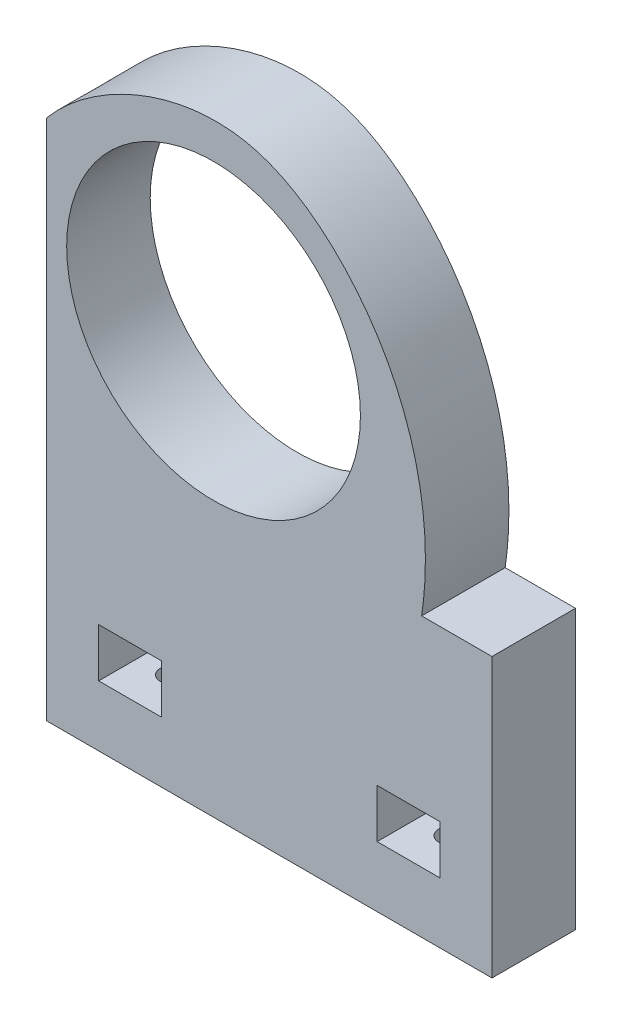
ISO-10303-21;
HEADER;
FILE_DESCRIPTION(('STEP AP214'),'2;1');
FILE_NAME('part.step','',(''),(''),'','','');
FILE_SCHEMA(('AUTOMOTIVE_DESIGN { 1 0 10303 214 1 1 1 1 }'));
ENDSEC;
DATA;
#1=APPLICATION_CONTEXT('core data for automotive mechanical design processes');
#2=APPLICATION_PROTOCOL_DEFINITION('international standard','automotive_design',2000,#1);
#3=PRODUCT_CONTEXT('',#1,'mechanical');
#4=PRODUCT('Part','Part','',(#3));
#5=PRODUCT_RELATED_PRODUCT_CATEGORY('part','',(#4));
#6=PRODUCT_DEFINITION_FORMATION('','',#4);
#7=PRODUCT_DEFINITION_CONTEXT('part definition',#1,'design');
#8=PRODUCT_DEFINITION('design','',#6,#7);
#9=PRODUCT_DEFINITION_SHAPE('','',#8);
#10=(LENGTH_UNIT() NAMED_UNIT(*) SI_UNIT(.MILLI.,.METRE.));
#11=(NAMED_UNIT(*) PLANE_ANGLE_UNIT() SI_UNIT($,.RADIAN.));
#12=(NAMED_UNIT(*) SI_UNIT($,.STERADIAN.) SOLID_ANGLE_UNIT());
#13=UNCERTAINTY_MEASURE_WITH_UNIT(LENGTH_MEASURE(1.E-05),#10,'distance_accuracy_value','');
#14=(GEOMETRIC_REPRESENTATION_CONTEXT(3) GLOBAL_UNCERTAINTY_ASSIGNED_CONTEXT((#13)) GLOBAL_UNIT_ASSIGNED_CONTEXT((#10,
#11,#12)) REPRESENTATION_CONTEXT('',''));
#15=CARTESIAN_POINT('',(0.,0.,0.));
#16=DIRECTION('',(0.,0.,1.));
#17=DIRECTION('',(1.,0.,0.));
#18=AXIS2_PLACEMENT_3D('',#15,#16,#17);
#19=CARTESIAN_POINT('',(-32.,55.,12.));
#20=CARTESIAN_POINT('',(-25.4672585375101,62.875582675928,12.));
#21=CARTESIAN_POINT('',(-5.81735149897092,72.0292699085318,12.));
#22=CARTESIAN_POINT('',(19.3343852914669,52.0751938029211,12.));
#23=CARTESIAN_POINT('',(23.7759075944806,32.7099363786866,12.));
#24=CARTESIAN_POINT('',(21.8947368421052,20.,12.));
#25=B_SPLINE_CURVE_WITH_KNOTS('',3,(#19,#20,#21,#22,#23,#24),.UNSPECIFIED.,.F.,.F.,(4,1,1,4),
(0.,0.370538339523064,0.573066510900843,1.),.UNSPECIFIED.);
#26=DIRECTION('',(0.,0.,-1.));
#27=VECTOR('',#26,1.);
#28=SURFACE_OF_LINEAR_EXTRUSION('',#25,#27);
#29=CARTESIAN_POINT('',(-32.,55.,0.));
#30=CARTESIAN_POINT('',(-25.4672585375101,62.875582675928,0.));
#31=CARTESIAN_POINT('',(-5.81735149897092,72.0292699085318,0.));
#32=CARTESIAN_POINT('',(19.3343852914669,52.0751938029211,0.));
#33=CARTESIAN_POINT('',(23.7759075944806,32.7099363786866,0.));
#34=CARTESIAN_POINT('',(21.8947368421052,20.,0.));
#35=B_SPLINE_CURVE_WITH_KNOTS('',3,(#29,#30,#31,#32,#33,#34),.UNSPECIFIED.,.F.,.F.,(4,1,1,4),
(0.,0.370538339523064,0.573066510900843,1.),.UNSPECIFIED.);
#36=CARTESIAN_POINT('',(-32.,55.,0.));
#37=VERTEX_POINT('',#36);
#38=CARTESIAN_POINT('',(21.8947368421052,20.,0.));
#39=VERTEX_POINT('',#38);
#40=EDGE_CURVE('E220',#37,#39,#35,.T.);
#41=ORIENTED_EDGE('',*,*,#40,.F.);
#42=DIRECTION('',(0.,0.,-1.));
#43=VECTOR('',#42,1.);
#44=CARTESIAN_POINT('',(-32.,55.,12.));
#45=LINE('',#44,#43);
#46=CARTESIAN_POINT('',(-32.,55.,12.));
#47=VERTEX_POINT('',#46);
#48=EDGE_CURVE('E11',#47,#37,#45,.T.);
#49=ORIENTED_EDGE('',*,*,#48,.F.);
#50=CARTESIAN_POINT('',(21.8947368421052,20.,12.));
#51=VERTEX_POINT('',#50);
#52=EDGE_CURVE('E222',#47,#51,#25,.T.);
#53=ORIENTED_EDGE('',*,*,#52,.T.);
#54=DIRECTION('',(0.,0.,-1.));
#55=VECTOR('',#54,1.);
#56=CARTESIAN_POINT('',(21.8947368421052,20.,12.));
#57=LINE('',#56,#55);
#58=EDGE_CURVE('E242',#51,#39,#57,.T.);
#59=ORIENTED_EDGE('',*,*,#58,.T.);
#60=EDGE_LOOP('',(#41,#49,#53,#59));
#61=FACE_BOUND('',#60,.T.);
#62=ADVANCED_FACE('F44',(#61),#28,.T.);
#63=CARTESIAN_POINT('',(-32.,0.,12.));
#64=DIRECTION('',(-1.,0.,0.));
#65=DIRECTION('',(0.,0.,1.));
#66=AXIS2_PLACEMENT_3D('',#63,#64,#65);
#67=PLANE('',#66);
#68=DIRECTION('',(0.,1.,0.));
#69=VECTOR('',#68,1.);
#70=CARTESIAN_POINT('',(-32.,0.,0.));
#71=LINE('',#70,#69);
#72=CARTESIAN_POINT('',(-32.,-20.,0.));
#73=VERTEX_POINT('',#72);
#74=EDGE_CURVE('E247',#73,#37,#71,.T.);
#75=ORIENTED_EDGE('',*,*,#74,.F.);
#76=DIRECTION('',(0.,0.,-1.));
#77=VECTOR('',#76,1.);
#78=CARTESIAN_POINT('',(-32.,-20.,12.));
#79=LINE('',#78,#77);
#80=CARTESIAN_POINT('',(-32.,-20.,12.));
#81=VERTEX_POINT('',#80);
#82=EDGE_CURVE('E53',#81,#73,#79,.T.);
#83=ORIENTED_EDGE('',*,*,#82,.F.);
#84=DIRECTION('',(0.,1.,0.));
#85=VECTOR('',#84,1.);
#86=CARTESIAN_POINT('',(-32.,0.,12.));
#87=LINE('',#86,#85);
#88=EDGE_CURVE('E228',#81,#47,#87,.T.);
#89=ORIENTED_EDGE('',*,*,#88,.T.);
#90=ORIENTED_EDGE('',*,*,#48,.T.);
#91=EDGE_LOOP('',(#75,#83,#89,#90));
#92=FACE_BOUND('',#91,.T.);
#93=ADVANCED_FACE('F291',(#92),#67,.T.);
#94=CARTESIAN_POINT('',(0.,-20.,12.));
#95=DIRECTION('',(0.,1.,0.));
#96=DIRECTION('',(-1.,0.,0.));
#97=AXIS2_PLACEMENT_3D('',#94,#95,#96);
#98=PLANE('',#97);
#99=CARTESIAN_POINT('',(-20.,-20.,6.));
#100=DIRECTION('',(0.,-1.,0.));
#101=DIRECTION('',(1.,0.,0.));
#102=AXIS2_PLACEMENT_3D('',#99,#100,#101);
#103=CIRCLE('',#102,1.65);
#104=CARTESIAN_POINT('',(-18.35,-20.,6.));
#105=VERTEX_POINT('',#104);
#106=EDGE_CURVE('E210',#105,#105,#103,.T.);
#107=ORIENTED_EDGE('',*,*,#106,.F.);
#108=EDGE_LOOP('',(#107));
#109=FACE_BOUND('',#108,.T.);
#110=CARTESIAN_POINT('',(20.,-20.,6.));
#111=DIRECTION('',(0.,-1.,0.));
#112=DIRECTION('',(1.,0.,0.));
#113=AXIS2_PLACEMENT_3D('',#110,#111,#112);
#114=CIRCLE('',#113,1.65);
#115=CARTESIAN_POINT('',(21.65,-20.,6.));
#116=VERTEX_POINT('',#115);
#117=EDGE_CURVE('E214',#116,#116,#114,.T.);
#118=ORIENTED_EDGE('',*,*,#117,.F.);
#119=EDGE_LOOP('',(#118));
#120=FACE_BOUND('',#119,.T.);
#121=DIRECTION('',(1.,0.,0.));
#122=VECTOR('',#121,1.);
#123=CARTESIAN_POINT('',(0.,-20.,0.));
#124=LINE('',#123,#122);
#125=CARTESIAN_POINT('',(32.,-20.,0.));
#126=VERTEX_POINT('',#125);
#127=EDGE_CURVE('E253',#73,#126,#124,.T.);
#128=ORIENTED_EDGE('',*,*,#127,.T.);
#129=DIRECTION('',(0.,0.,-1.));
#130=VECTOR('',#129,1.);
#131=CARTESIAN_POINT('',(32.,-20.,12.));
#132=LINE('',#131,#130);
#133=CARTESIAN_POINT('',(32.,-20.,12.));
#134=VERTEX_POINT('',#133);
#135=EDGE_CURVE('E263',#134,#126,#132,.T.);
#136=ORIENTED_EDGE('',*,*,#135,.F.);
#137=DIRECTION('',(1.,0.,0.));
#138=VECTOR('',#137,1.);
#139=CARTESIAN_POINT('',(0.,-20.,12.));
#140=LINE('',#139,#138);
#141=EDGE_CURVE('E235',#81,#134,#140,.T.);
#142=ORIENTED_EDGE('',*,*,#141,.F.);
#143=ORIENTED_EDGE('',*,*,#82,.T.);
#144=EDGE_LOOP('',(#128,#136,#142,#143));
#145=FACE_BOUND('',#144,.T.);
#146=ADVANCED_FACE('F296',(#109,#120,#145),#98,.F.);
#147=CARTESIAN_POINT('',(32.,0.,12.));
#148=DIRECTION('',(-1.,0.,0.));
#149=DIRECTION('',(0.,0.,1.));
#150=AXIS2_PLACEMENT_3D('',#147,#148,#149);
#151=PLANE('',#150);
#152=DIRECTION('',(0.,1.,0.));
#153=VECTOR('',#152,1.);
#154=CARTESIAN_POINT('',(32.,0.,0.));
#155=LINE('',#154,#153);
#156=CARTESIAN_POINT('',(32.,20.,0.));
#157=VERTEX_POINT('',#156);
#158=EDGE_CURVE('E255',#126,#157,#155,.T.);
#159=ORIENTED_EDGE('',*,*,#158,.T.);
#160=DIRECTION('',(0.,0.,-1.));
#161=VECTOR('',#160,1.);
#162=CARTESIAN_POINT('',(32.,20.,12.));
#163=LINE('',#162,#161);
#164=CARTESIAN_POINT('',(32.,20.,12.));
#165=VERTEX_POINT('',#164);
#166=EDGE_CURVE('E261',#165,#157,#163,.T.);
#167=ORIENTED_EDGE('',*,*,#166,.F.);
#168=DIRECTION('',(0.,1.,0.));
#169=VECTOR('',#168,1.);
#170=CARTESIAN_POINT('',(32.,0.,12.));
#171=LINE('',#170,#169);
#172=EDGE_CURVE('E237',#134,#165,#171,.T.);
#173=ORIENTED_EDGE('',*,*,#172,.F.);
#174=ORIENTED_EDGE('',*,*,#135,.T.);
#175=EDGE_LOOP('',(#159,#167,#173,#174));
#176=FACE_BOUND('',#175,.T.);
#177=ADVANCED_FACE('F316',(#176),#151,.F.);
#178=CARTESIAN_POINT('',(0.,20.,12.));
#179=DIRECTION('',(0.,1.,0.));
#180=DIRECTION('',(0.,0.,1.));
#181=AXIS2_PLACEMENT_3D('',#178,#179,#180);
#182=PLANE('',#181);
#183=DIRECTION('',(1.,0.,0.));
#184=VECTOR('',#183,1.);
#185=CARTESIAN_POINT('',(0.,20.,0.));
#186=LINE('',#185,#184);
#187=EDGE_CURVE('E229',#39,#157,#186,.T.);
#188=ORIENTED_EDGE('',*,*,#187,.F.);
#189=ORIENTED_EDGE('',*,*,#58,.F.);
#190=DIRECTION('',(1.,0.,0.));
#191=VECTOR('',#190,1.);
#192=CARTESIAN_POINT('',(0.,20.,12.));
#193=LINE('',#192,#191);
#194=EDGE_CURVE('E239',#51,#165,#193,.T.);
#195=ORIENTED_EDGE('',*,*,#194,.T.);
#196=ORIENTED_EDGE('',*,*,#166,.T.);
#197=EDGE_LOOP('',(#188,#189,#195,#196));
#198=FACE_BOUND('',#197,.T.);
#199=ADVANCED_FACE('F314',(#198),#182,.T.);
#200=CARTESIAN_POINT('',(0.,0.,12.));
#201=DIRECTION('',(0.,0.,1.));
#202=DIRECTION('',(1.,0.,0.));
#203=AXIS2_PLACEMENT_3D('',#200,#201,#202);
#204=PLANE('',#203);
#205=DIRECTION('',(0.,1.,0.));
#206=VECTOR('',#205,1.);
#207=CARTESIAN_POINT('',(-15.5,-4.28285008654741,12.));
#208=LINE('',#207,#206);
#209=CARTESIAN_POINT('',(-15.5,-11.2828500865474,12.));
#210=VERTEX_POINT('',#209);
#211=CARTESIAN_POINT('',(-15.5,-4.28285008654741,12.));
#212=VERTEX_POINT('',#211);
#213=EDGE_CURVE('E61',#210,#212,#208,.T.);
#214=ORIENTED_EDGE('',*,*,#213,.F.);
#215=DIRECTION('',(1.,0.,0.));
#216=VECTOR('',#215,1.);
#217=CARTESIAN_POINT('',(-24.5,-11.2828500865474,12.));
#218=LINE('',#217,#216);
#219=CARTESIAN_POINT('',(-24.5,-11.2828500865474,12.));
#220=VERTEX_POINT('',#219);
#221=EDGE_CURVE('E161',#220,#210,#218,.T.);
#222=ORIENTED_EDGE('',*,*,#221,.F.);
#223=DIRECTION('',(0.,-1.,0.));
#224=VECTOR('',#223,1.);
#225=CARTESIAN_POINT('',(-24.5,-4.28285008654741,12.));
#226=LINE('',#225,#224);
#227=CARTESIAN_POINT('',(-24.5,-4.28285008654741,12.));
#228=VERTEX_POINT('',#227);
#229=EDGE_CURVE('E164',#228,#220,#226,.T.);
#230=ORIENTED_EDGE('',*,*,#229,.F.);
#231=DIRECTION('',(-1.,0.,0.));
#232=VECTOR('',#231,1.);
#233=CARTESIAN_POINT('',(-24.5,-4.28285008654741,12.));
#234=LINE('',#233,#232);
#235=EDGE_CURVE('E170',#212,#228,#234,.T.);
#236=ORIENTED_EDGE('',*,*,#235,.F.);
#237=EDGE_LOOP('',(#214,#222,#230,#236));
#238=FACE_BOUND('',#237,.T.);
#239=DIRECTION('',(1.,0.,0.));
#240=VECTOR('',#239,1.);
#241=CARTESIAN_POINT('',(15.5,-11.2828500865474,12.));
#242=LINE('',#241,#240);
#243=CARTESIAN_POINT('',(15.5,-11.2828500865474,12.));
#244=VERTEX_POINT('',#243);
#245=CARTESIAN_POINT('',(24.5,-11.2828500865474,12.));
#246=VERTEX_POINT('',#245);
#247=EDGE_CURVE('E69',#244,#246,#242,.T.);
#248=ORIENTED_EDGE('',*,*,#247,.F.);
#249=DIRECTION('',(0.,-1.,0.));
#250=VECTOR('',#249,1.);
#251=CARTESIAN_POINT('',(15.5,-4.28285008654741,12.));
#252=LINE('',#251,#250);
#253=CARTESIAN_POINT('',(15.5,-4.28285008654741,12.));
#254=VERTEX_POINT('',#253);
#255=EDGE_CURVE('E189',#254,#244,#252,.T.);
#256=ORIENTED_EDGE('',*,*,#255,.F.);
#257=DIRECTION('',(-1.,0.,0.));
#258=VECTOR('',#257,1.);
#259=CARTESIAN_POINT('',(15.5,-4.28285008654741,12.));
#260=LINE('',#259,#258);
#261=CARTESIAN_POINT('',(24.5,-4.28285008654741,12.));
#262=VERTEX_POINT('',#261);
#263=EDGE_CURVE('E192',#262,#254,#260,.T.);
#264=ORIENTED_EDGE('',*,*,#263,.F.);
#265=DIRECTION('',(0.,1.,0.));
#266=VECTOR('',#265,1.);
#267=CARTESIAN_POINT('',(24.5,-4.28285008654741,12.));
#268=LINE('',#267,#266);
#269=EDGE_CURVE('E196',#246,#262,#268,.T.);
#270=ORIENTED_EDGE('',*,*,#269,.F.);
#271=EDGE_LOOP('',(#248,#256,#264,#270));
#272=FACE_BOUND('',#271,.T.);
#273=CARTESIAN_POINT('',(-8.,40.5,12.));
#274=DIRECTION('',(0.,0.,1.));
#275=DIRECTION('',(1.,0.,0.));
#276=AXIS2_PLACEMENT_3D('',#273,#274,#275);
#277=CIRCLE('',#276,21.1);
#278=CARTESIAN_POINT('',(13.1,40.5,12.));
#279=VERTEX_POINT('',#278);
#280=EDGE_CURVE('E213',#279,#279,#277,.T.);
#281=ORIENTED_EDGE('',*,*,#280,.F.);
#282=EDGE_LOOP('',(#281));
#283=FACE_BOUND('',#282,.T.);
#284=ORIENTED_EDGE('',*,*,#52,.F.);
#285=ORIENTED_EDGE('',*,*,#88,.F.);
#286=ORIENTED_EDGE('',*,*,#141,.T.);
#287=ORIENTED_EDGE('',*,*,#172,.T.);
#288=ORIENTED_EDGE('',*,*,#194,.F.);
#289=EDGE_LOOP('',(#284,#285,#286,#287,#288));
#290=FACE_BOUND('',#289,.T.);
#291=ADVANCED_FACE('F308',(#238,#272,#283,#290),#204,.T.);
#292=CARTESIAN_POINT('',(0.,0.,0.));
#293=DIRECTION('',(0.,0.,1.));
#294=DIRECTION('',(1.,0.,0.));
#295=AXIS2_PLACEMENT_3D('',#292,#293,#294);
#296=PLANE('',#295);
#297=DIRECTION('',(1.,0.,0.));
#298=VECTOR('',#297,1.);
#299=CARTESIAN_POINT('',(-24.5,-11.2828500865474,0.));
#300=LINE('',#299,#298);
#301=CARTESIAN_POINT('',(-24.5,-11.2828500865474,0.));
#302=VERTEX_POINT('',#301);
#303=CARTESIAN_POINT('',(-15.5,-11.2828500865474,0.));
#304=VERTEX_POINT('',#303);
#305=EDGE_CURVE('E148',#302,#304,#300,.T.);
#306=ORIENTED_EDGE('',*,*,#305,.T.);
#307=DIRECTION('',(0.,1.,0.));
#308=VECTOR('',#307,1.);
#309=CARTESIAN_POINT('',(-15.5,-4.28285008654741,0.));
#310=LINE('',#309,#308);
#311=CARTESIAN_POINT('',(-15.5,-4.28285008654741,0.));
#312=VERTEX_POINT('',#311);
#313=EDGE_CURVE('E142',#304,#312,#310,.T.);
#314=ORIENTED_EDGE('',*,*,#313,.T.);
#315=DIRECTION('',(-1.,0.,0.));
#316=VECTOR('',#315,1.);
#317=CARTESIAN_POINT('',(-24.5,-4.28285008654741,0.));
#318=LINE('',#317,#316);
#319=CARTESIAN_POINT('',(-24.5,-4.28285008654741,0.));
#320=VERTEX_POINT('',#319);
#321=EDGE_CURVE('E152',#312,#320,#318,.T.);
#322=ORIENTED_EDGE('',*,*,#321,.T.);
#323=DIRECTION('',(0.,-1.,0.));
#324=VECTOR('',#323,1.);
#325=CARTESIAN_POINT('',(-24.5,-4.28285008654741,0.));
#326=LINE('',#325,#324);
#327=EDGE_CURVE('E156',#320,#302,#326,.T.);
#328=ORIENTED_EDGE('',*,*,#327,.T.);
#329=EDGE_LOOP('',(#306,#314,#322,#328));
#330=FACE_BOUND('',#329,.T.);
#331=DIRECTION('',(0.,-1.,0.));
#332=VECTOR('',#331,1.);
#333=CARTESIAN_POINT('',(15.5,-4.28285008654741,0.));
#334=LINE('',#333,#332);
#335=CARTESIAN_POINT('',(15.5,-4.28285008654741,0.));
#336=VERTEX_POINT('',#335);
#337=CARTESIAN_POINT('',(15.5,-11.2828500865474,0.));
#338=VERTEX_POINT('',#337);
#339=EDGE_CURVE('E182',#336,#338,#334,.T.);
#340=ORIENTED_EDGE('',*,*,#339,.T.);
#341=DIRECTION('',(1.,0.,0.));
#342=VECTOR('',#341,1.);
#343=CARTESIAN_POINT('',(15.5,-11.2828500865474,0.));
#344=LINE('',#343,#342);
#345=CARTESIAN_POINT('',(24.5,-11.2828500865474,0.));
#346=VERTEX_POINT('',#345);
#347=EDGE_CURVE('E193',#338,#346,#344,.T.);
#348=ORIENTED_EDGE('',*,*,#347,.T.);
#349=DIRECTION('',(0.,1.,0.));
#350=VECTOR('',#349,1.);
#351=CARTESIAN_POINT('',(24.5,-4.28285008654741,0.));
#352=LINE('',#351,#350);
#353=CARTESIAN_POINT('',(24.5,-4.28285008654741,0.));
#354=VERTEX_POINT('',#353);
#355=EDGE_CURVE('E205',#346,#354,#352,.T.);
#356=ORIENTED_EDGE('',*,*,#355,.T.);
#357=DIRECTION('',(-1.,0.,0.));
#358=VECTOR('',#357,1.);
#359=CARTESIAN_POINT('',(15.5,-4.28285008654741,0.));
#360=LINE('',#359,#358);
#361=EDGE_CURVE('E202',#354,#336,#360,.T.);
#362=ORIENTED_EDGE('',*,*,#361,.T.);
#363=EDGE_LOOP('',(#340,#348,#356,#362));
#364=FACE_BOUND('',#363,.T.);
#365=CARTESIAN_POINT('',(-8.,40.5,0.));
#366=DIRECTION('',(0.,0.,1.));
#367=DIRECTION('',(1.,0.,0.));
#368=AXIS2_PLACEMENT_3D('',#365,#366,#367);
#369=CIRCLE('',#368,21.1);
#370=CARTESIAN_POINT('',(13.1,40.5,0.));
#371=VERTEX_POINT('',#370);
#372=EDGE_CURVE('E217',#371,#371,#369,.T.);
#373=ORIENTED_EDGE('',*,*,#372,.T.);
#374=EDGE_LOOP('',(#373));
#375=FACE_BOUND('',#374,.T.);
#376=ORIENTED_EDGE('',*,*,#40,.T.);
#377=ORIENTED_EDGE('',*,*,#187,.T.);
#378=ORIENTED_EDGE('',*,*,#158,.F.);
#379=ORIENTED_EDGE('',*,*,#127,.F.);
#380=ORIENTED_EDGE('',*,*,#74,.T.);
#381=EDGE_LOOP('',(#376,#377,#378,#379,#380));
#382=FACE_BOUND('',#381,.T.);
#383=ADVANCED_FACE('F158',(#330,#364,#375,#382),#296,.F.);
#384=CARTESIAN_POINT('',(-8.,40.5,0.));
#385=DIRECTION('',(0.,0.,1.));
#386=DIRECTION('',(1.,0.,0.));
#387=AXIS2_PLACEMENT_3D('',#384,#385,#386);
#388=CYLINDRICAL_SURFACE('',#387,21.1);
#389=ORIENTED_EDGE('',*,*,#372,.F.);
#390=EDGE_LOOP('',(#389));
#391=FACE_BOUND('',#390,.T.);
#392=ORIENTED_EDGE('',*,*,#280,.T.);
#393=EDGE_LOOP('',(#392));
#394=FACE_BOUND('',#393,.T.);
#395=ADVANCED_FACE('F334',(#391,#394),#388,.F.);
#396=CARTESIAN_POINT('',(20.,-10.,6.));
#397=DIRECTION('',(0.,-1.,0.));
#398=DIRECTION('',(1.,0.,0.));
#399=AXIS2_PLACEMENT_3D('',#396,#397,#398);
#400=CYLINDRICAL_SURFACE('',#399,1.65);
#401=CARTESIAN_POINT('',(20.,-11.2828500865474,6.));
#402=DIRECTION('',(0.,-1.,0.));
#403=DIRECTION('',(0.,0.,-1.));
#404=AXIS2_PLACEMENT_3D('',#401,#402,#403);
#405=CIRCLE('',#404,1.65);
#406=CARTESIAN_POINT('',(20.,-11.2828500865474,4.35));
#407=VERTEX_POINT('',#406);
#408=EDGE_CURVE('E48',#407,#407,#405,.F.);
#409=ORIENTED_EDGE('',*,*,#408,.T.);
#410=EDGE_LOOP('',(#409));
#411=FACE_BOUND('',#410,.T.);
#412=ORIENTED_EDGE('',*,*,#117,.T.);
#413=EDGE_LOOP('',(#412));
#414=FACE_BOUND('',#413,.T.);
#415=ADVANCED_FACE('F272',(#411,#414),#400,.F.);
#416=CARTESIAN_POINT('',(-20.,-10.,6.));
#417=DIRECTION('',(0.,-1.,0.));
#418=DIRECTION('',(1.,0.,0.));
#419=AXIS2_PLACEMENT_3D('',#416,#417,#418);
#420=CYLINDRICAL_SURFACE('',#419,1.65);
#421=CARTESIAN_POINT('',(-20.,-11.2828500865474,6.));
#422=DIRECTION('',(0.,-1.,0.));
#423=DIRECTION('',(0.,0.,-1.));
#424=AXIS2_PLACEMENT_3D('',#421,#422,#423);
#425=CIRCLE('',#424,1.65);
#426=CARTESIAN_POINT('',(-20.,-11.2828500865474,4.35));
#427=VERTEX_POINT('',#426);
#428=EDGE_CURVE('E176',#427,#427,#425,.F.);
#429=ORIENTED_EDGE('',*,*,#428,.T.);
#430=EDGE_LOOP('',(#429));
#431=FACE_BOUND('',#430,.T.);
#432=ORIENTED_EDGE('',*,*,#106,.T.);
#433=EDGE_LOOP('',(#432));
#434=FACE_BOUND('',#433,.T.);
#435=ADVANCED_FACE('F341',(#431,#434),#420,.F.);
#436=CARTESIAN_POINT('',(-24.5,-11.2828500865474,0.));
#437=DIRECTION('',(0.,-1.,0.));
#438=DIRECTION('',(0.,0.,-1.));
#439=AXIS2_PLACEMENT_3D('',#436,#437,#438);
#440=PLANE('',#439);
#441=ORIENTED_EDGE('',*,*,#221,.T.);
#442=DIRECTION('',(0.,0.,1.));
#443=VECTOR('',#442,1.);
#444=CARTESIAN_POINT('',(-15.5,-11.2828500865474,0.));
#445=LINE('',#444,#443);
#446=EDGE_CURVE('E174',#304,#210,#445,.T.);
#447=ORIENTED_EDGE('',*,*,#446,.F.);
#448=ORIENTED_EDGE('',*,*,#305,.F.);
#449=DIRECTION('',(0.,0.,1.));
#450=VECTOR('',#449,1.);
#451=CARTESIAN_POINT('',(-24.5,-11.2828500865474,0.));
#452=LINE('',#451,#450);
#453=EDGE_CURVE('E177',#302,#220,#452,.T.);
#454=ORIENTED_EDGE('',*,*,#453,.T.);
#455=EDGE_LOOP('',(#441,#447,#448,#454));
#456=FACE_BOUND('',#455,.T.);
#457=ORIENTED_EDGE('',*,*,#428,.F.);
#458=EDGE_LOOP('',(#457));
#459=FACE_BOUND('',#458,.T.);
#460=ADVANCED_FACE('F343',(#456,#459),#440,.F.);
#461=CARTESIAN_POINT('',(-15.5,-4.28285008654741,0.));
#462=DIRECTION('',(1.,0.,0.));
#463=DIRECTION('',(0.,1.,0.));
#464=AXIS2_PLACEMENT_3D('',#461,#462,#463);
#465=PLANE('',#464);
#466=ORIENTED_EDGE('',*,*,#213,.T.);
#467=DIRECTION('',(0.,0.,1.));
#468=VECTOR('',#467,1.);
#469=CARTESIAN_POINT('',(-15.5,-4.28285008654741,0.));
#470=LINE('',#469,#468);
#471=EDGE_CURVE('E138',#312,#212,#470,.T.);
#472=ORIENTED_EDGE('',*,*,#471,.F.);
#473=ORIENTED_EDGE('',*,*,#313,.F.);
#474=ORIENTED_EDGE('',*,*,#446,.T.);
#475=EDGE_LOOP('',(#466,#472,#473,#474));
#476=FACE_BOUND('',#475,.T.);
#477=ADVANCED_FACE('F140',(#476),#465,.F.);
#478=CARTESIAN_POINT('',(-24.5,-4.28285008654741,0.));
#479=DIRECTION('',(-1.,0.,0.));
#480=DIRECTION('',(0.,0.,1.));
#481=AXIS2_PLACEMENT_3D('',#478,#479,#480);
#482=PLANE('',#481);
#483=ORIENTED_EDGE('',*,*,#229,.T.);
#484=ORIENTED_EDGE('',*,*,#453,.F.);
#485=ORIENTED_EDGE('',*,*,#327,.F.);
#486=DIRECTION('',(0.,0.,1.));
#487=VECTOR('',#486,1.);
#488=CARTESIAN_POINT('',(-24.5,-4.28285008654741,0.));
#489=LINE('',#488,#487);
#490=EDGE_CURVE('E147',#320,#228,#489,.T.);
#491=ORIENTED_EDGE('',*,*,#490,.T.);
#492=EDGE_LOOP('',(#483,#484,#485,#491));
#493=FACE_BOUND('',#492,.T.);
#494=ADVANCED_FACE('F286',(#493),#482,.F.);
#495=CARTESIAN_POINT('',(-24.5,-4.28285008654741,0.));
#496=DIRECTION('',(0.,1.,0.));
#497=DIRECTION('',(0.,0.,1.));
#498=AXIS2_PLACEMENT_3D('',#495,#496,#497);
#499=PLANE('',#498);
#500=ORIENTED_EDGE('',*,*,#235,.T.);
#501=ORIENTED_EDGE('',*,*,#490,.F.);
#502=ORIENTED_EDGE('',*,*,#321,.F.);
#503=ORIENTED_EDGE('',*,*,#471,.T.);
#504=EDGE_LOOP('',(#500,#501,#502,#503));
#505=FACE_BOUND('',#504,.T.);
#506=ADVANCED_FACE('F153',(#505),#499,.F.);
#507=CARTESIAN_POINT('',(15.5,-11.2828500865474,0.));
#508=DIRECTION('',(0.,-1.,0.));
#509=DIRECTION('',(0.,0.,-1.));
#510=AXIS2_PLACEMENT_3D('',#507,#508,#509);
#511=PLANE('',#510);
#512=ORIENTED_EDGE('',*,*,#247,.T.);
#513=DIRECTION('',(0.,0.,1.));
#514=VECTOR('',#513,1.);
#515=CARTESIAN_POINT('',(24.5,-11.2828500865474,0.));
#516=LINE('',#515,#514);
#517=EDGE_CURVE('E180',#346,#246,#516,.T.);
#518=ORIENTED_EDGE('',*,*,#517,.F.);
#519=ORIENTED_EDGE('',*,*,#347,.F.);
#520=DIRECTION('',(0.,0.,1.));
#521=VECTOR('',#520,1.);
#522=CARTESIAN_POINT('',(15.5,-11.2828500865474,0.));
#523=LINE('',#522,#521);
#524=EDGE_CURVE('E187',#338,#244,#523,.T.);
#525=ORIENTED_EDGE('',*,*,#524,.T.);
#526=EDGE_LOOP('',(#512,#518,#519,#525));
#527=FACE_BOUND('',#526,.T.);
#528=ORIENTED_EDGE('',*,*,#408,.F.);
#529=EDGE_LOOP('',(#528));
#530=FACE_BOUND('',#529,.T.);
#531=ADVANCED_FACE('F275',(#527,#530),#511,.F.);
#532=CARTESIAN_POINT('',(15.5,-4.28285008654741,0.));
#533=DIRECTION('',(-1.,0.,0.));
#534=DIRECTION('',(0.,0.,1.));
#535=AXIS2_PLACEMENT_3D('',#532,#533,#534);
#536=PLANE('',#535);
#537=ORIENTED_EDGE('',*,*,#255,.T.);
#538=ORIENTED_EDGE('',*,*,#524,.F.);
#539=ORIENTED_EDGE('',*,*,#339,.F.);
#540=DIRECTION('',(0.,0.,1.));
#541=VECTOR('',#540,1.);
#542=CARTESIAN_POINT('',(15.5,-4.28285008654741,0.));
#543=LINE('',#542,#541);
#544=EDGE_CURVE('E185',#336,#254,#543,.T.);
#545=ORIENTED_EDGE('',*,*,#544,.T.);
#546=EDGE_LOOP('',(#537,#538,#539,#545));
#547=FACE_BOUND('',#546,.T.);
#548=ADVANCED_FACE('F277',(#547),#536,.F.);
#549=CARTESIAN_POINT('',(15.5,-4.28285008654741,0.));
#550=DIRECTION('',(0.,1.,0.));
#551=DIRECTION('',(0.,0.,1.));
#552=AXIS2_PLACEMENT_3D('',#549,#550,#551);
#553=PLANE('',#552);
#554=ORIENTED_EDGE('',*,*,#263,.T.);
#555=ORIENTED_EDGE('',*,*,#544,.F.);
#556=ORIENTED_EDGE('',*,*,#361,.F.);
#557=DIRECTION('',(0.,0.,1.));
#558=VECTOR('',#557,1.);
#559=CARTESIAN_POINT('',(24.5,-4.28285008654741,0.));
#560=LINE('',#559,#558);
#561=EDGE_CURVE('E183',#354,#262,#560,.T.);
#562=ORIENTED_EDGE('',*,*,#561,.T.);
#563=EDGE_LOOP('',(#554,#555,#556,#562));
#564=FACE_BOUND('',#563,.T.);
#565=ADVANCED_FACE('F283',(#564),#553,.F.);
#566=CARTESIAN_POINT('',(24.5,-4.28285008654741,0.));
#567=DIRECTION('',(1.,0.,0.));
#568=DIRECTION('',(0.,1.,0.));
#569=AXIS2_PLACEMENT_3D('',#566,#567,#568);
#570=PLANE('',#569);
#571=ORIENTED_EDGE('',*,*,#269,.T.);
#572=ORIENTED_EDGE('',*,*,#561,.F.);
#573=ORIENTED_EDGE('',*,*,#355,.F.);
#574=ORIENTED_EDGE('',*,*,#517,.T.);
#575=EDGE_LOOP('',(#571,#572,#573,#574));
#576=FACE_BOUND('',#575,.T.);
#577=ADVANCED_FACE('F346',(#576),#570,.F.);
#578=CLOSED_SHELL('',(#62,#93,#146,#177,#199,#291,#383,#395,#415,#435,#460,#477,#494,#506,#531,
#548,#565,#577));
#579=MANIFOLD_SOLID_BREP('B2',#578);
#580=ADVANCED_BREP_SHAPE_REPRESENTATION('',(#18,#579),#14);
#581=SHAPE_DEFINITION_REPRESENTATION(#9,#580);
ENDSEC;
END-ISO-10303-21;
